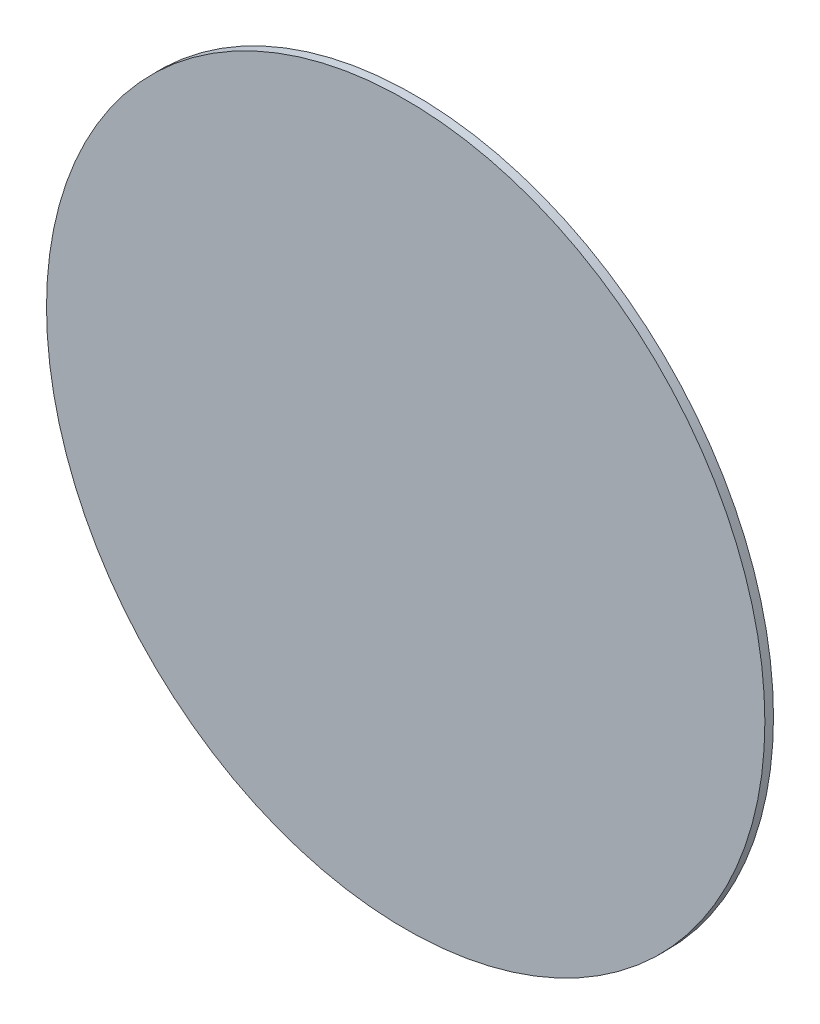
ISO-10303-21;
HEADER;
FILE_DESCRIPTION(('STEP AP214'),'2;1');
FILE_NAME('part.step','',(''),(''),'','','');
FILE_SCHEMA(('AUTOMOTIVE_DESIGN { 1 0 10303 214 1 1 1 1 }'));
ENDSEC;
DATA;
#1=APPLICATION_CONTEXT('core data for automotive mechanical design processes');
#2=APPLICATION_PROTOCOL_DEFINITION('international standard','automotive_design',2000,#1);
#3=PRODUCT_CONTEXT('',#1,'mechanical');
#4=PRODUCT('Part','Part','',(#3));
#5=PRODUCT_RELATED_PRODUCT_CATEGORY('part','',(#4));
#6=PRODUCT_DEFINITION_FORMATION('','',#4);
#7=PRODUCT_DEFINITION_CONTEXT('part definition',#1,'design');
#8=PRODUCT_DEFINITION('design','',#6,#7);
#9=PRODUCT_DEFINITION_SHAPE('','',#8);
#10=(LENGTH_UNIT() NAMED_UNIT(*) SI_UNIT(.MILLI.,.METRE.));
#11=(NAMED_UNIT(*) PLANE_ANGLE_UNIT() SI_UNIT($,.RADIAN.));
#12=(NAMED_UNIT(*) SI_UNIT($,.STERADIAN.) SOLID_ANGLE_UNIT());
#13=UNCERTAINTY_MEASURE_WITH_UNIT(LENGTH_MEASURE(1.E-05),#10,'distance_accuracy_value','');
#14=(GEOMETRIC_REPRESENTATION_CONTEXT(3) GLOBAL_UNCERTAINTY_ASSIGNED_CONTEXT((#13)) GLOBAL_UNIT_ASSIGNED_CONTEXT((#10,
#11,#12)) REPRESENTATION_CONTEXT('',''));
#15=CARTESIAN_POINT('',(0.,0.,0.));
#16=DIRECTION('',(0.,0.,1.));
#17=DIRECTION('',(1.,0.,0.));
#18=AXIS2_PLACEMENT_3D('',#15,#16,#17);
#19=CARTESIAN_POINT('',(0.,0.,3.));
#20=DIRECTION('',(0.,0.,-1.));
#21=DIRECTION('',(-1.,0.,0.));
#22=AXIS2_PLACEMENT_3D('',#19,#20,#21);
#23=CYLINDRICAL_SURFACE('',#22,125.);
#24=CARTESIAN_POINT('',(0.,0.,3.));
#25=DIRECTION('',(0.,0.,1.));
#26=DIRECTION('',(1.,0.,0.));
#27=AXIS2_PLACEMENT_3D('',#24,#25,#26);
#28=CIRCLE('',#27,125.);
#29=CARTESIAN_POINT('',(125.,0.,3.));
#30=VERTEX_POINT('',#29);
#31=EDGE_CURVE('E10',#30,#30,#28,.T.);
#32=ORIENTED_EDGE('',*,*,#31,.F.);
#33=EDGE_LOOP('',(#32));
#34=FACE_BOUND('',#33,.T.);
#35=CARTESIAN_POINT('',(0.,0.,0.));
#36=DIRECTION('',(0.,0.,1.));
#37=DIRECTION('',(1.,0.,0.));
#38=AXIS2_PLACEMENT_3D('',#35,#36,#37);
#39=CIRCLE('',#38,125.);
#40=CARTESIAN_POINT('',(125.,0.,0.));
#41=VERTEX_POINT('',#40);
#42=EDGE_CURVE('E34',#41,#41,#39,.T.);
#43=ORIENTED_EDGE('',*,*,#42,.T.);
#44=EDGE_LOOP('',(#43));
#45=FACE_BOUND('',#44,.T.);
#46=ADVANCED_FACE('F31',(#34,#45),#23,.T.);
#47=CARTESIAN_POINT('',(0.,0.,3.));
#48=DIRECTION('',(0.,0.,1.));
#49=DIRECTION('',(1.,0.,0.));
#50=AXIS2_PLACEMENT_3D('',#47,#48,#49);
#51=PLANE('',#50);
#52=ORIENTED_EDGE('',*,*,#31,.T.);
#53=EDGE_LOOP('',(#52));
#54=FACE_BOUND('',#53,.T.);
#55=ADVANCED_FACE('F46',(#54),#51,.T.);
#56=CARTESIAN_POINT('',(0.,0.,0.));
#57=DIRECTION('',(0.,0.,1.));
#58=DIRECTION('',(1.,0.,0.));
#59=AXIS2_PLACEMENT_3D('',#56,#57,#58);
#60=PLANE('',#59);
#61=ORIENTED_EDGE('',*,*,#42,.F.);
#62=EDGE_LOOP('',(#61));
#63=FACE_BOUND('',#62,.T.);
#64=ADVANCED_FACE('F44',(#63),#60,.F.);
#65=CLOSED_SHELL('',(#46,#55,#64));
#66=MANIFOLD_SOLID_BREP('B2',#65);
#67=ADVANCED_BREP_SHAPE_REPRESENTATION('',(#18,#66),#14);
#68=SHAPE_DEFINITION_REPRESENTATION(#9,#67);
ENDSEC;
END-ISO-10303-21;
